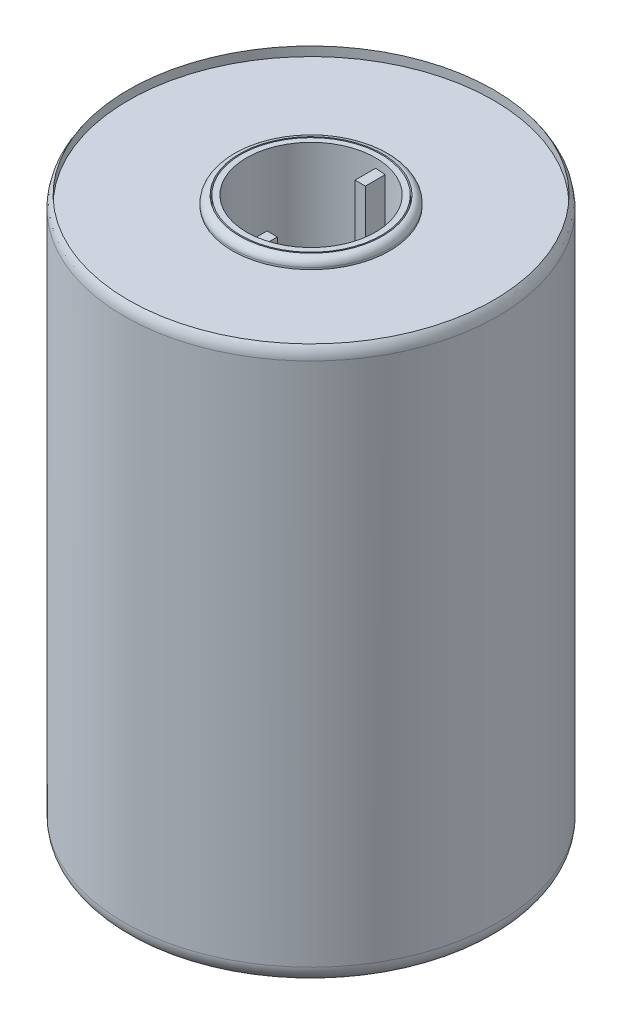
ISO-10303-21;
HEADER;
FILE_DESCRIPTION(('STEP AP214'),'2;1');
FILE_NAME('part.step','',(''),(''),'','','');
FILE_SCHEMA(('AUTOMOTIVE_DESIGN { 1 0 10303 214 1 1 1 1 }'));
ENDSEC;
DATA;
#1=APPLICATION_CONTEXT('core data for automotive mechanical design processes');
#2=APPLICATION_PROTOCOL_DEFINITION('international standard','automotive_design',2000,#1);
#3=PRODUCT_CONTEXT('',#1,'mechanical');
#4=PRODUCT('Part','Part','',(#3));
#5=PRODUCT_RELATED_PRODUCT_CATEGORY('part','',(#4));
#6=PRODUCT_DEFINITION_FORMATION('','',#4);
#7=PRODUCT_DEFINITION_CONTEXT('part definition',#1,'design');
#8=PRODUCT_DEFINITION('design','',#6,#7);
#9=PRODUCT_DEFINITION_SHAPE('','',#8);
#10=(LENGTH_UNIT() NAMED_UNIT(*) SI_UNIT(.MILLI.,.METRE.));
#11=(NAMED_UNIT(*) PLANE_ANGLE_UNIT() SI_UNIT($,.RADIAN.));
#12=(NAMED_UNIT(*) SI_UNIT($,.STERADIAN.) SOLID_ANGLE_UNIT());
#13=UNCERTAINTY_MEASURE_WITH_UNIT(LENGTH_MEASURE(1.E-05),#10,'distance_accuracy_value','');
#14=(GEOMETRIC_REPRESENTATION_CONTEXT(3) GLOBAL_UNCERTAINTY_ASSIGNED_CONTEXT((#13)) GLOBAL_UNIT_ASSIGNED_CONTEXT((#10,
#11,#12)) REPRESENTATION_CONTEXT('',''));
#15=CARTESIAN_POINT('',(0.,0.,0.));
#16=DIRECTION('',(0.,0.,1.));
#17=DIRECTION('',(1.,0.,0.));
#18=AXIS2_PLACEMENT_3D('',#15,#16,#17);
#19=CARTESIAN_POINT('',(0.,147.5,0.));
#20=DIRECTION('',(0.,1.,0.));
#21=DIRECTION('',(0.,0.,1.));
#22=AXIS2_PLACEMENT_3D('',#19,#20,#21);
#23=PLANE('',#22);
#24=CARTESIAN_POINT('',(0.,147.5,0.));
#25=DIRECTION('',(0.,1.,0.));
#26=DIRECTION('',(0.,0.,1.));
#27=AXIS2_PLACEMENT_3D('',#24,#25,#26);
#28=CIRCLE('',#27,19.1218292024238);
#29=CARTESIAN_POINT('',(0.,147.5,19.1218292024238));
#30=VERTEX_POINT('',#29);
#31=EDGE_CURVE('E174',#30,#30,#28,.T.);
#32=ORIENTED_EDGE('',*,*,#31,.F.);
#33=EDGE_LOOP('',(#32));
#34=FACE_BOUND('',#33,.T.);
#35=CARTESIAN_POINT('',(0.,147.5,0.));
#36=DIRECTION('',(0.,1.,0.));
#37=DIRECTION('',(0.,0.,1.));
#38=AXIS2_PLACEMENT_3D('',#35,#36,#37);
#39=CIRCLE('',#38,19.4629871836898);
#40=CARTESIAN_POINT('',(0.,147.5,19.4629871836898));
#41=VERTEX_POINT('',#40);
#42=EDGE_CURVE('E207',#41,#41,#39,.F.);
#43=ORIENTED_EDGE('',*,*,#42,.F.);
#44=EDGE_LOOP('',(#43));
#45=FACE_BOUND('',#44,.T.);
#46=ADVANCED_FACE('F37',(#34,#45),#23,.T.);
#47=CARTESIAN_POINT('',(0.,0.,0.));
#48=DIRECTION('',(0.,1.,0.));
#49=DIRECTION('',(0.,0.,1.));
#50=AXIS2_PLACEMENT_3D('',#47,#48,#49);
#51=CYLINDRICAL_SURFACE('',#50,17.5714106184439);
#52=DIRECTION('',(0.,1.,0.));
#53=VECTOR('',#52,1.);
#54=CARTESIAN_POINT('',(0.,2.5,17.5714106184439));
#55=LINE('',#54,#53);
#56=CARTESIAN_POINT('',(0.,2.5,17.5714106184439));
#57=VERTEX_POINT('',#56);
#58=CARTESIAN_POINT('',(0.,147.5,17.5714106184439));
#59=VERTEX_POINT('',#58);
#60=EDGE_CURVE('E57',#57,#59,#55,.T.);
#61=ORIENTED_EDGE('',*,*,#60,.F.);
#62=CARTESIAN_POINT('',(0.,2.5,0.));
#63=DIRECTION('',(0.,-1.,0.));
#64=DIRECTION('',(0.,0.,-1.));
#65=AXIS2_PLACEMENT_3D('',#62,#63,#64);
#66=CIRCLE('',#65,17.5714106184439);
#67=CARTESIAN_POINT('',(2.81398906962431,2.5,17.344622700941));
#68=VERTEX_POINT('',#67);
#69=EDGE_CURVE('E52',#57,#68,#66,.F.);
#70=ORIENTED_EDGE('',*,*,#69,.T.);
#71=DIRECTION('',(0.,1.,0.));
#72=VECTOR('',#71,1.);
#73=CARTESIAN_POINT('',(2.81398906962431,0.,17.344622700941));
#74=LINE('',#73,#72);
#75=CARTESIAN_POINT('',(2.81398906962431,147.5,17.344622700941));
#76=VERTEX_POINT('',#75);
#77=EDGE_CURVE('E106',#68,#76,#74,.T.);
#78=ORIENTED_EDGE('',*,*,#77,.T.);
#79=CARTESIAN_POINT('',(0.,147.5,0.));
#80=DIRECTION('',(0.,-1.,0.));
#81=DIRECTION('',(0.,0.,-1.));
#82=AXIS2_PLACEMENT_3D('',#79,#80,#81);
#83=CIRCLE('',#82,17.5714106184439);
#84=EDGE_CURVE('E202',#59,#76,#83,.F.);
#85=ORIENTED_EDGE('',*,*,#84,.F.);
#86=EDGE_LOOP('',(#61,#70,#78,#85));
#87=FACE_BOUND('',#86,.T.);
#88=CARTESIAN_POINT('',(0.,150.,0.));
#89=DIRECTION('',(0.,1.,0.));
#90=DIRECTION('',(0.,0.,1.));
#91=AXIS2_PLACEMENT_3D('',#88,#89,#90);
#92=CIRCLE('',#91,17.5714106184439);
#93=CARTESIAN_POINT('',(0.,150.,17.5714106184439));
#94=VERTEX_POINT('',#93);
#95=EDGE_CURVE('E183',#94,#94,#92,.T.);
#96=ORIENTED_EDGE('',*,*,#95,.T.);
#97=EDGE_LOOP('',(#96));
#98=FACE_BOUND('',#97,.T.);
#99=CARTESIAN_POINT('',(0.,0.,0.));
#100=DIRECTION('',(0.,1.,0.));
#101=DIRECTION('',(0.,0.,1.));
#102=AXIS2_PLACEMENT_3D('',#99,#100,#101);
#103=CIRCLE('',#102,17.5714106184439);
#104=CARTESIAN_POINT('',(0.,0.,17.5714106184439));
#105=VERTEX_POINT('',#104);
#106=EDGE_CURVE('E186',#105,#105,#103,.T.);
#107=ORIENTED_EDGE('',*,*,#106,.F.);
#108=EDGE_LOOP('',(#107));
#109=FACE_BOUND('',#108,.T.);
#110=CARTESIAN_POINT('',(0.,2.5,0.));
#111=DIRECTION('',(0.,1.,0.));
#112=DIRECTION('',(0.,0.,1.));
#113=AXIS2_PLACEMENT_3D('',#110,#111,#112);
#114=CIRCLE('',#113,17.5714106184439);
#115=CARTESIAN_POINT('',(0.,2.5,-17.5714106184439));
#116=VERTEX_POINT('',#115);
#117=CARTESIAN_POINT('',(2.81398906962431,2.5,-17.344622700941));
#118=VERTEX_POINT('',#117);
#119=EDGE_CURVE('E200',#116,#118,#114,.F.);
#120=ORIENTED_EDGE('',*,*,#119,.F.);
#121=DIRECTION('',(0.,1.,0.));
#122=VECTOR('',#121,1.);
#123=CARTESIAN_POINT('',(0.,2.5,-17.5714106184439));
#124=LINE('',#123,#122);
#125=CARTESIAN_POINT('',(0.,147.5,-17.5714106184439));
#126=VERTEX_POINT('',#125);
#127=EDGE_CURVE('E152',#116,#126,#124,.T.);
#128=ORIENTED_EDGE('',*,*,#127,.T.);
#129=CARTESIAN_POINT('',(0.,147.5,0.));
#130=DIRECTION('',(0.,1.,0.));
#131=DIRECTION('',(0.,0.,1.));
#132=AXIS2_PLACEMENT_3D('',#129,#130,#131);
#133=CIRCLE('',#132,17.5714106184439);
#134=CARTESIAN_POINT('',(2.81398906962431,147.5,-17.344622700941));
#135=VERTEX_POINT('',#134);
#136=EDGE_CURVE('E194',#126,#135,#133,.F.);
#137=ORIENTED_EDGE('',*,*,#136,.T.);
#138=DIRECTION('',(0.,1.,0.));
#139=VECTOR('',#138,1.);
#140=CARTESIAN_POINT('',(2.81398906962431,0.,-17.344622700941));
#141=LINE('',#140,#139);
#142=EDGE_CURVE('E197',#135,#118,#141,.F.);
#143=ORIENTED_EDGE('',*,*,#142,.T.);
#144=EDGE_LOOP('',(#120,#128,#137,#143));
#145=FACE_BOUND('',#144,.T.);
#146=ADVANCED_FACE('F247',(#87,#98,#109,#145),#51,.F.);
#147=CARTESIAN_POINT('',(0.,0.,0.));
#148=DIRECTION('',(0.,1.,0.));
#149=DIRECTION('',(0.,0.,1.));
#150=AXIS2_PLACEMENT_3D('',#147,#148,#149);
#151=PLANE('',#150);
#152=ORIENTED_EDGE('',*,*,#106,.T.);
#153=EDGE_LOOP('',(#152));
#154=FACE_BOUND('',#153,.T.);
#155=CARTESIAN_POINT('',(0.,0.,0.));
#156=DIRECTION('',(0.,-1.,0.));
#157=DIRECTION('',(0.,0.,-1.));
#158=AXIS2_PLACEMENT_3D('',#155,#156,#157);
#159=CIRCLE('',#158,17.829813715774);
#160=CARTESIAN_POINT('',(0.,0.,-17.829813715774));
#161=VERTEX_POINT('',#160);
#162=EDGE_CURVE('E165',#161,#161,#159,.T.);
#163=ORIENTED_EDGE('',*,*,#162,.T.);
#164=EDGE_LOOP('',(#163));
#165=FACE_BOUND('',#164,.T.);
#166=ADVANCED_FACE('F252',(#154,#165),#151,.F.);
#167=CARTESIAN_POINT('',(0.,150.,0.));
#168=DIRECTION('',(0.,1.,0.));
#169=DIRECTION('',(0.,0.,1.));
#170=AXIS2_PLACEMENT_3D('',#167,#168,#169);
#171=PLANE('',#170);
#172=ORIENTED_EDGE('',*,*,#95,.F.);
#173=EDGE_LOOP('',(#172));
#174=FACE_BOUND('',#173,.T.);
#175=CARTESIAN_POINT('',(0.,150.,0.));
#176=DIRECTION('',(0.,1.,0.));
#177=DIRECTION('',(0.,0.,1.));
#178=AXIS2_PLACEMENT_3D('',#175,#176,#177);
#179=CIRCLE('',#178,19.1218292024238);
#180=CARTESIAN_POINT('',(0.,150.,19.1218292024238));
#181=VERTEX_POINT('',#180);
#182=EDGE_CURVE('E171',#181,#181,#179,.T.);
#183=ORIENTED_EDGE('',*,*,#182,.T.);
#184=EDGE_LOOP('',(#183));
#185=FACE_BOUND('',#184,.T.);
#186=ADVANCED_FACE('F242',(#174,#185),#171,.T.);
#187=CARTESIAN_POINT('',(0.,150.,0.));
#188=DIRECTION('',(0.,-1.,0.));
#189=DIRECTION('',(0.,0.,-1.));
#190=AXIS2_PLACEMENT_3D('',#187,#188,#189);
#191=CYLINDRICAL_SURFACE('',#190,50.8900947095449);
#192=CARTESIAN_POINT('',(0.,146.783812157475,0.));
#193=DIRECTION('',(0.,1.,0.));
#194=DIRECTION('',(0.,0.,1.));
#195=AXIS2_PLACEMENT_3D('',#192,#193,#194);
#196=CIRCLE('',#195,50.8900947095449);
#197=CARTESIAN_POINT('',(0.,146.783812157475,50.8900947095449));
#198=VERTEX_POINT('',#197);
#199=EDGE_CURVE('E45',#198,#198,#196,.F.);
#200=ORIENTED_EDGE('',*,*,#199,.T.);
#201=EDGE_LOOP('',(#200));
#202=FACE_BOUND('',#201,.T.);
#203=CARTESIAN_POINT('',(0.,3.717971644845,0.));
#204=DIRECTION('',(0.,-1.,0.));
#205=DIRECTION('',(0.,0.,-1.));
#206=AXIS2_PLACEMENT_3D('',#203,#204,#205);
#207=CIRCLE('',#206,50.8900947095449);
#208=CARTESIAN_POINT('',(0.,3.717971644845,-50.8900947095449));
#209=VERTEX_POINT('',#208);
#210=EDGE_CURVE('E210',#209,#209,#207,.F.);
#211=ORIENTED_EDGE('',*,*,#210,.T.);
#212=EDGE_LOOP('',(#211));
#213=FACE_BOUND('',#212,.T.);
#214=ADVANCED_FACE('F221',(#202,#213),#191,.T.);
#215=CARTESIAN_POINT('',(0.,147.5,0.));
#216=DIRECTION('',(0.,1.,0.));
#217=DIRECTION('',(0.,0.,1.));
#218=AXIS2_PLACEMENT_3D('',#215,#216,#217);
#219=CYLINDRICAL_SURFACE('',#218,49.7184279972298);
#220=CARTESIAN_POINT('',(0.,147.5,0.));
#221=DIRECTION('',(0.,1.,0.));
#222=DIRECTION('',(0.,0.,1.));
#223=AXIS2_PLACEMENT_3D('',#220,#221,#222);
#224=CIRCLE('',#223,49.7184279972298);
#225=CARTESIAN_POINT('',(0.,147.5,49.7184279972298));
#226=VERTEX_POINT('',#225);
#227=EDGE_CURVE('E180',#226,#226,#224,.T.);
#228=ORIENTED_EDGE('',*,*,#227,.F.);
#229=EDGE_LOOP('',(#228));
#230=FACE_BOUND('',#229,.T.);
#231=CARTESIAN_POINT('',(0.,150.,0.));
#232=DIRECTION('',(0.,1.,0.));
#233=DIRECTION('',(0.,0.,1.));
#234=AXIS2_PLACEMENT_3D('',#231,#232,#233);
#235=CIRCLE('',#234,49.7184279972298);
#236=CARTESIAN_POINT('',(0.,150.,49.7184279972298));
#237=VERTEX_POINT('',#236);
#238=EDGE_CURVE('E177',#237,#237,#235,.T.);
#239=ORIENTED_EDGE('',*,*,#238,.T.);
#240=EDGE_LOOP('',(#239));
#241=FACE_BOUND('',#240,.T.);
#242=ADVANCED_FACE('F230',(#230,#241),#219,.F.);
#243=CARTESIAN_POINT('',(0.,147.5,0.));
#244=DIRECTION('',(0.,1.,0.));
#245=DIRECTION('',(0.,0.,1.));
#246=AXIS2_PLACEMENT_3D('',#243,#244,#245);
#247=CIRCLE('',#246,21.4211400149472);
#248=CARTESIAN_POINT('',(0.,147.5,21.4211400149472));
#249=VERTEX_POINT('',#248);
#250=EDGE_CURVE('E130',#249,#249,#247,.T.);
#251=ORIENTED_EDGE('',*,*,#250,.F.);
#252=EDGE_LOOP('',(#251));
#253=FACE_BOUND('',#252,.T.);
#254=ORIENTED_EDGE('',*,*,#227,.T.);
#255=EDGE_LOOP('',(#254));
#256=FACE_BOUND('',#255,.T.);
#257=ADVANCED_FACE('F232',(#253,#256),#23,.T.);
#258=CARTESIAN_POINT('',(0.,147.5,0.));
#259=DIRECTION('',(0.,1.,0.));
#260=DIRECTION('',(0.,0.,1.));
#261=AXIS2_PLACEMENT_3D('',#258,#259,#260);
#262=CYLINDRICAL_SURFACE('',#261,19.1218292024238);
#263=ORIENTED_EDGE('',*,*,#31,.T.);
#264=EDGE_LOOP('',(#263));
#265=FACE_BOUND('',#264,.T.);
#266=ORIENTED_EDGE('',*,*,#182,.F.);
#267=EDGE_LOOP('',(#266));
#268=FACE_BOUND('',#267,.T.);
#269=ADVANCED_FACE('F239',(#265,#268),#262,.T.);
#270=CARTESIAN_POINT('',(0.,-15.,0.));
#271=DIRECTION('',(0.,1.,0.));
#272=DIRECTION('',(0.,0.,1.));
#273=AXIS2_PLACEMENT_3D('',#270,#271,#272);
#274=CYLINDRICAL_SURFACE('',#273,19.4768924120961);
#275=CARTESIAN_POINT('',(0.,-11.2908331486245,0.));
#276=DIRECTION('',(0.,-1.,0.));
#277=DIRECTION('',(0.,0.,-1.));
#278=AXIS2_PLACEMENT_3D('',#275,#276,#277);
#279=CIRCLE('',#278,19.4768924120961);
#280=CARTESIAN_POINT('',(0.,-11.2908331486245,-19.4768924120961));
#281=VERTEX_POINT('',#280);
#282=EDGE_CURVE('E213',#281,#281,#279,.F.);
#283=ORIENTED_EDGE('',*,*,#282,.T.);
#284=EDGE_LOOP('',(#283));
#285=FACE_BOUND('',#284,.T.);
#286=CARTESIAN_POINT('',(0.,0.,0.));
#287=DIRECTION('',(0.,1.,0.));
#288=DIRECTION('',(0.,0.,1.));
#289=AXIS2_PLACEMENT_3D('',#286,#287,#288);
#290=CIRCLE('',#289,19.4768924120961);
#291=CARTESIAN_POINT('',(0.,0.,19.4768924120961));
#292=VERTEX_POINT('',#291);
#293=EDGE_CURVE('E189',#292,#292,#290,.F.);
#294=ORIENTED_EDGE('',*,*,#293,.T.);
#295=EDGE_LOOP('',(#294));
#296=FACE_BOUND('',#295,.T.);
#297=ADVANCED_FACE('F258',(#285,#296),#274,.T.);
#298=CARTESIAN_POINT('',(0.,-15.,0.));
#299=DIRECTION('',(0.,1.,0.));
#300=DIRECTION('',(0.,0.,1.));
#301=AXIS2_PLACEMENT_3D('',#298,#299,#300);
#302=CYLINDRICAL_SURFACE('',#301,17.829813715774);
#303=CARTESIAN_POINT('',(0.,-15.,0.));
#304=DIRECTION('',(0.,-1.,0.));
#305=DIRECTION('',(0.,0.,-1.));
#306=AXIS2_PLACEMENT_3D('',#303,#304,#305);
#307=CIRCLE('',#306,17.829813715774);
#308=CARTESIAN_POINT('',(0.,-15.,-17.829813715774));
#309=VERTEX_POINT('',#308);
#310=EDGE_CURVE('E168',#309,#309,#307,.T.);
#311=ORIENTED_EDGE('',*,*,#310,.T.);
#312=EDGE_LOOP('',(#311));
#313=FACE_BOUND('',#312,.T.);
#314=ORIENTED_EDGE('',*,*,#162,.F.);
#315=EDGE_LOOP('',(#314));
#316=FACE_BOUND('',#315,.T.);
#317=ADVANCED_FACE('F262',(#313,#316),#302,.F.);
#318=CARTESIAN_POINT('',(0.,5.,0.));
#319=DIRECTION('',(0.,-1.,0.));
#320=DIRECTION('',(0.,0.,-1.));
#321=AXIS2_PLACEMENT_3D('',#318,#319,#320);
#322=CYLINDRICAL_SURFACE('',#321,49.233249933002);
#323=CARTESIAN_POINT('',(0.,5.,0.));
#324=DIRECTION('',(0.,-1.,0.));
#325=DIRECTION('',(0.,0.,-1.));
#326=AXIS2_PLACEMENT_3D('',#323,#324,#325);
#327=CIRCLE('',#326,49.233249933002);
#328=CARTESIAN_POINT('',(0.,5.,-49.233249933002));
#329=VERTEX_POINT('',#328);
#330=EDGE_CURVE('E162',#329,#329,#327,.T.);
#331=ORIENTED_EDGE('',*,*,#330,.F.);
#332=EDGE_LOOP('',(#331));
#333=FACE_BOUND('',#332,.T.);
#334=CARTESIAN_POINT('',(0.,0.,0.));
#335=DIRECTION('',(0.,-1.,0.));
#336=DIRECTION('',(0.,0.,-1.));
#337=AXIS2_PLACEMENT_3D('',#334,#335,#336);
#338=CIRCLE('',#337,49.233249933002);
#339=CARTESIAN_POINT('',(0.,0.,-49.233249933002));
#340=VERTEX_POINT('',#339);
#341=EDGE_CURVE('E161',#340,#340,#338,.T.);
#342=ORIENTED_EDGE('',*,*,#341,.T.);
#343=EDGE_LOOP('',(#342));
#344=FACE_BOUND('',#343,.T.);
#345=ADVANCED_FACE('F266',(#333,#344),#322,.F.);
#346=CARTESIAN_POINT('',(0.,5.,0.));
#347=DIRECTION('',(0.,-1.,0.));
#348=DIRECTION('',(0.,0.,-1.));
#349=AXIS2_PLACEMENT_3D('',#346,#347,#348);
#350=PLANE('',#349);
#351=CARTESIAN_POINT('',(0.,5.,0.));
#352=DIRECTION('',(0.,-1.,0.));
#353=DIRECTION('',(0.,0.,-1.));
#354=AXIS2_PLACEMENT_3D('',#351,#352,#353);
#355=CIRCLE('',#354,21.5317394756691);
#356=CARTESIAN_POINT('',(0.,5.,-21.5317394756691));
#357=VERTEX_POINT('',#356);
#358=EDGE_CURVE('E155',#357,#357,#355,.T.);
#359=ORIENTED_EDGE('',*,*,#358,.F.);
#360=EDGE_LOOP('',(#359));
#361=FACE_BOUND('',#360,.T.);
#362=ORIENTED_EDGE('',*,*,#330,.T.);
#363=EDGE_LOOP('',(#362));
#364=FACE_BOUND('',#363,.T.);
#365=ADVANCED_FACE('F270',(#361,#364),#350,.T.);
#366=CARTESIAN_POINT('',(0.,5.,0.));
#367=DIRECTION('',(0.,-1.,0.));
#368=DIRECTION('',(0.,0.,-1.));
#369=AXIS2_PLACEMENT_3D('',#366,#367,#368);
#370=CYLINDRICAL_SURFACE('',#369,21.5317394756691);
#371=CARTESIAN_POINT('',(0.,4.04055369733593,0.));
#372=DIRECTION('',(0.,-1.,0.));
#373=DIRECTION('',(0.,0.,-1.));
#374=AXIS2_PLACEMENT_3D('',#371,#372,#373);
#375=CIRCLE('',#374,21.5317394756691);
#376=CARTESIAN_POINT('',(0.,4.04055369733593,-21.5317394756691));
#377=VERTEX_POINT('',#376);
#378=EDGE_CURVE('E216',#377,#377,#375,.F.);
#379=ORIENTED_EDGE('',*,*,#378,.T.);
#380=EDGE_LOOP('',(#379));
#381=FACE_BOUND('',#380,.T.);
#382=ORIENTED_EDGE('',*,*,#358,.T.);
#383=EDGE_LOOP('',(#382));
#384=FACE_BOUND('',#383,.T.);
#385=ADVANCED_FACE('F274',(#381,#384),#370,.T.);
#386=CARTESIAN_POINT('',(2.81398906962431,2.5,-17.5714106184439));
#387=DIRECTION('',(1.,0.,0.));
#388=DIRECTION('',(0.,0.,-1.));
#389=AXIS2_PLACEMENT_3D('',#386,#387,#388);
#390=PLANE('',#389);
#391=ORIENTED_EDGE('',*,*,#142,.F.);
#392=DIRECTION('',(0.,0.,-1.));
#393=VECTOR('',#392,1.);
#394=CARTESIAN_POINT('',(2.81398906962431,147.5,-17.5714106184439));
#395=LINE('',#394,#393);
#396=CARTESIAN_POINT('',(2.81398906962431,147.5,-11.9952929361759));
#397=VERTEX_POINT('',#396);
#398=EDGE_CURVE('E139',#397,#135,#395,.T.);
#399=ORIENTED_EDGE('',*,*,#398,.F.);
#400=DIRECTION('',(0.,1.,0.));
#401=VECTOR('',#400,1.);
#402=CARTESIAN_POINT('',(2.81398906962431,2.5,-11.9952929361759));
#403=LINE('',#402,#401);
#404=CARTESIAN_POINT('',(2.81398906962431,2.5,-11.9952929361759));
#405=VERTEX_POINT('',#404);
#406=EDGE_CURVE('E156',#405,#397,#403,.T.);
#407=ORIENTED_EDGE('',*,*,#406,.F.);
#408=DIRECTION('',(0.,0.,-1.));
#409=VECTOR('',#408,1.);
#410=CARTESIAN_POINT('',(2.81398906962431,2.5,-17.5714106184439));
#411=LINE('',#410,#409);
#412=EDGE_CURVE('E142',#405,#118,#411,.T.);
#413=ORIENTED_EDGE('',*,*,#412,.T.);
#414=EDGE_LOOP('',(#391,#399,#407,#413));
#415=FACE_BOUND('',#414,.T.);
#416=ADVANCED_FACE('F278',(#415),#390,.T.);
#417=CARTESIAN_POINT('',(0.,2.5,0.));
#418=DIRECTION('',(0.,1.,0.));
#419=DIRECTION('',(0.,0.,1.));
#420=AXIS2_PLACEMENT_3D('',#417,#418,#419);
#421=PLANE('',#420);
#422=DIRECTION('',(0.,0.,1.));
#423=VECTOR('',#422,1.);
#424=CARTESIAN_POINT('',(0.,2.5,-17.5714106184439));
#425=LINE('',#424,#423);
#426=CARTESIAN_POINT('',(0.,2.5,-11.9952929361759));
#427=VERTEX_POINT('',#426);
#428=EDGE_CURVE('E135',#116,#427,#425,.T.);
#429=ORIENTED_EDGE('',*,*,#428,.F.);
#430=ORIENTED_EDGE('',*,*,#119,.T.);
#431=ORIENTED_EDGE('',*,*,#412,.F.);
#432=DIRECTION('',(1.,0.,0.));
#433=VECTOR('',#432,1.);
#434=CARTESIAN_POINT('',(0.,2.5,-11.9952929361759));
#435=LINE('',#434,#433);
#436=EDGE_CURVE('E138',#427,#405,#435,.T.);
#437=ORIENTED_EDGE('',*,*,#436,.F.);
#438=EDGE_LOOP('',(#429,#430,#431,#437));
#439=FACE_BOUND('',#438,.T.);
#440=ADVANCED_FACE('F291',(#439),#421,.F.);
#441=CARTESIAN_POINT('',(0.,147.5,0.));
#442=DIRECTION('',(0.,1.,0.));
#443=DIRECTION('',(0.,0.,1.));
#444=AXIS2_PLACEMENT_3D('',#441,#442,#443);
#445=PLANE('',#444);
#446=ORIENTED_EDGE('',*,*,#136,.F.);
#447=DIRECTION('',(0.,0.,1.));
#448=VECTOR('',#447,1.);
#449=CARTESIAN_POINT('',(0.,147.5,-17.5714106184439));
#450=LINE('',#449,#448);
#451=CARTESIAN_POINT('',(0.,147.5,-11.9952929361759));
#452=VERTEX_POINT('',#451);
#453=EDGE_CURVE('E133',#126,#452,#450,.T.);
#454=ORIENTED_EDGE('',*,*,#453,.T.);
#455=DIRECTION('',(1.,0.,0.));
#456=VECTOR('',#455,1.);
#457=CARTESIAN_POINT('',(0.,147.5,-11.9952929361759));
#458=LINE('',#457,#456);
#459=EDGE_CURVE('E148',#452,#397,#458,.T.);
#460=ORIENTED_EDGE('',*,*,#459,.T.);
#461=ORIENTED_EDGE('',*,*,#398,.T.);
#462=EDGE_LOOP('',(#446,#454,#460,#461));
#463=FACE_BOUND('',#462,.T.);
#464=ADVANCED_FACE('F284',(#463),#445,.T.);
#465=CARTESIAN_POINT('',(0.,2.5,-17.5714106184439));
#466=DIRECTION('',(-1.,0.,0.));
#467=DIRECTION('',(0.,0.,1.));
#468=AXIS2_PLACEMENT_3D('',#465,#466,#467);
#469=PLANE('',#468);
#470=ORIENTED_EDGE('',*,*,#453,.F.);
#471=ORIENTED_EDGE('',*,*,#127,.F.);
#472=ORIENTED_EDGE('',*,*,#428,.T.);
#473=DIRECTION('',(0.,1.,0.));
#474=VECTOR('',#473,1.);
#475=CARTESIAN_POINT('',(0.,2.5,-11.9952929361759));
#476=LINE('',#475,#474);
#477=EDGE_CURVE('E145',#427,#452,#476,.T.);
#478=ORIENTED_EDGE('',*,*,#477,.T.);
#479=EDGE_LOOP('',(#470,#471,#472,#478));
#480=FACE_BOUND('',#479,.T.);
#481=ADVANCED_FACE('F280',(#480),#469,.T.);
#482=CARTESIAN_POINT('',(0.,2.5,-11.9952929361759));
#483=DIRECTION('',(0.,0.,1.));
#484=DIRECTION('',(1.,0.,0.));
#485=AXIS2_PLACEMENT_3D('',#482,#483,#484);
#486=PLANE('',#485);
#487=ORIENTED_EDGE('',*,*,#459,.F.);
#488=ORIENTED_EDGE('',*,*,#477,.F.);
#489=ORIENTED_EDGE('',*,*,#436,.T.);
#490=ORIENTED_EDGE('',*,*,#406,.T.);
#491=EDGE_LOOP('',(#487,#488,#489,#490));
#492=FACE_BOUND('',#491,.T.);
#493=ADVANCED_FACE('F283',(#492),#486,.T.);
#494=CARTESIAN_POINT('',(2.81398906962431,2.5,17.5714106184439));
#495=DIRECTION('',(1.,0.,0.));
#496=DIRECTION('',(0.,0.,-1.));
#497=AXIS2_PLACEMENT_3D('',#494,#495,#496);
#498=PLANE('',#497);
#499=ORIENTED_EDGE('',*,*,#77,.F.);
#500=DIRECTION('',(0.,0.,-1.));
#501=VECTOR('',#500,1.);
#502=CARTESIAN_POINT('',(2.81398906962431,2.5,17.5714106184439));
#503=LINE('',#502,#501);
#504=CARTESIAN_POINT('',(2.81398906962431,2.5,11.9952929361759));
#505=VERTEX_POINT('',#504);
#506=EDGE_CURVE('E100',#68,#505,#503,.T.);
#507=ORIENTED_EDGE('',*,*,#506,.T.);
#508=DIRECTION('',(0.,1.,0.));
#509=VECTOR('',#508,1.);
#510=CARTESIAN_POINT('',(2.81398906962431,2.5,11.9952929361759));
#511=LINE('',#510,#509);
#512=CARTESIAN_POINT('',(2.81398906962431,147.5,11.9952929361759));
#513=VERTEX_POINT('',#512);
#514=EDGE_CURVE('E104',#505,#513,#511,.T.);
#515=ORIENTED_EDGE('',*,*,#514,.T.);
#516=DIRECTION('',(0.,0.,-1.));
#517=VECTOR('',#516,1.);
#518=CARTESIAN_POINT('',(2.81398906962431,147.5,17.5714106184439));
#519=LINE('',#518,#517);
#520=EDGE_CURVE('E129',#76,#513,#519,.T.);
#521=ORIENTED_EDGE('',*,*,#520,.F.);
#522=EDGE_LOOP('',(#499,#507,#515,#521));
#523=FACE_BOUND('',#522,.T.);
#524=ADVANCED_FACE('F102',(#523),#498,.T.);
#525=CARTESIAN_POINT('',(0.,2.5,0.));
#526=DIRECTION('',(0.,-1.,0.));
#527=DIRECTION('',(0.,0.,-1.));
#528=AXIS2_PLACEMENT_3D('',#525,#526,#527);
#529=PLANE('',#528);
#530=ORIENTED_EDGE('',*,*,#69,.F.);
#531=DIRECTION('',(0.,0.,1.));
#532=VECTOR('',#531,1.);
#533=CARTESIAN_POINT('',(0.,2.5,17.5714106184439));
#534=LINE('',#533,#532);
#535=CARTESIAN_POINT('',(0.,2.5,11.9952929361759));
#536=VERTEX_POINT('',#535);
#537=EDGE_CURVE('E110',#536,#57,#534,.T.);
#538=ORIENTED_EDGE('',*,*,#537,.F.);
#539=DIRECTION('',(-1.,0.,0.));
#540=VECTOR('',#539,1.);
#541=CARTESIAN_POINT('',(0.,2.5,11.9952929361759));
#542=LINE('',#541,#540);
#543=EDGE_CURVE('E109',#505,#536,#542,.T.);
#544=ORIENTED_EDGE('',*,*,#543,.F.);
#545=ORIENTED_EDGE('',*,*,#506,.F.);
#546=EDGE_LOOP('',(#530,#538,#544,#545));
#547=FACE_BOUND('',#546,.T.);
#548=ADVANCED_FACE('F120',(#547),#529,.T.);
#549=CARTESIAN_POINT('',(0.,147.5,0.));
#550=DIRECTION('',(0.,-1.,0.));
#551=DIRECTION('',(0.,0.,-1.));
#552=AXIS2_PLACEMENT_3D('',#549,#550,#551);
#553=PLANE('',#552);
#554=DIRECTION('',(0.,0.,1.));
#555=VECTOR('',#554,1.);
#556=CARTESIAN_POINT('',(0.,147.5,17.5714106184439));
#557=LINE('',#556,#555);
#558=CARTESIAN_POINT('',(0.,147.5,11.9952929361759));
#559=VERTEX_POINT('',#558);
#560=EDGE_CURVE('E126',#559,#59,#557,.T.);
#561=ORIENTED_EDGE('',*,*,#560,.T.);
#562=ORIENTED_EDGE('',*,*,#84,.T.);
#563=ORIENTED_EDGE('',*,*,#520,.T.);
#564=DIRECTION('',(-1.,0.,0.));
#565=VECTOR('',#564,1.);
#566=CARTESIAN_POINT('',(0.,147.5,11.9952929361759));
#567=LINE('',#566,#565);
#568=EDGE_CURVE('E116',#513,#559,#567,.T.);
#569=ORIENTED_EDGE('',*,*,#568,.T.);
#570=EDGE_LOOP('',(#561,#562,#563,#569));
#571=FACE_BOUND('',#570,.T.);
#572=ADVANCED_FACE('F302',(#571),#553,.F.);
#573=CARTESIAN_POINT('',(0.,2.5,17.5714106184439));
#574=DIRECTION('',(-1.,0.,0.));
#575=DIRECTION('',(0.,0.,1.));
#576=AXIS2_PLACEMENT_3D('',#573,#574,#575);
#577=PLANE('',#576);
#578=ORIENTED_EDGE('',*,*,#560,.F.);
#579=DIRECTION('',(0.,1.,0.));
#580=VECTOR('',#579,1.);
#581=CARTESIAN_POINT('',(0.,2.5,11.9952929361759));
#582=LINE('',#581,#580);
#583=EDGE_CURVE('E117',#536,#559,#582,.T.);
#584=ORIENTED_EDGE('',*,*,#583,.F.);
#585=ORIENTED_EDGE('',*,*,#537,.T.);
#586=ORIENTED_EDGE('',*,*,#60,.T.);
#587=EDGE_LOOP('',(#578,#584,#585,#586));
#588=FACE_BOUND('',#587,.T.);
#589=ADVANCED_FACE('F299',(#588),#577,.T.);
#590=CARTESIAN_POINT('',(0.,2.5,11.9952929361759));
#591=DIRECTION('',(0.,0.,-1.));
#592=DIRECTION('',(-1.,0.,0.));
#593=AXIS2_PLACEMENT_3D('',#590,#591,#592);
#594=PLANE('',#593);
#595=ORIENTED_EDGE('',*,*,#568,.F.);
#596=ORIENTED_EDGE('',*,*,#514,.F.);
#597=ORIENTED_EDGE('',*,*,#543,.T.);
#598=ORIENTED_EDGE('',*,*,#583,.T.);
#599=EDGE_LOOP('',(#595,#596,#597,#598));
#600=FACE_BOUND('',#599,.T.);
#601=ADVANCED_FACE('F114',(#600),#594,.T.);
#602=CARTESIAN_POINT('',(0.,150.,0.));
#603=DIRECTION('',(0.,-1.,0.));
#604=DIRECTION('',(0.,0.,-1.));
#605=AXIS2_PLACEMENT_3D('',#602,#603,#604);
#606=CYLINDRICAL_SURFACE('',#605,21.4211400149472);
#607=CARTESIAN_POINT('',(0.,148.00043784431,0.));
#608=DIRECTION('',(0.,1.,0.));
#609=DIRECTION('',(0.,0.,1.));
#610=AXIS2_PLACEMENT_3D('',#607,#608,#609);
#611=CIRCLE('',#610,21.4211400149472);
#612=CARTESIAN_POINT('',(0.,148.00043784431,21.4211400149472));
#613=VERTEX_POINT('',#612);
#614=EDGE_CURVE('E11',#613,#613,#611,.F.);
#615=ORIENTED_EDGE('',*,*,#614,.T.);
#616=EDGE_LOOP('',(#615));
#617=FACE_BOUND('',#616,.T.);
#618=ORIENTED_EDGE('',*,*,#250,.T.);
#619=EDGE_LOOP('',(#618));
#620=FACE_BOUND('',#619,.T.);
#621=ADVANCED_FACE('F308',(#617,#620),#606,.T.);
#622=CARTESIAN_POINT('',(0.,150.,0.));
#623=DIRECTION('',(0.,-1.,0.));
#624=DIRECTION('',(0.,0.,-1.));
#625=AXIS2_PLACEMENT_3D('',#622,#623,#624);
#626=CYLINDRICAL_SURFACE('',#625,19.4629871836898);
#627=CARTESIAN_POINT('',(0.,150.,0.));
#628=DIRECTION('',(0.,1.,0.));
#629=DIRECTION('',(0.,0.,1.));
#630=AXIS2_PLACEMENT_3D('',#627,#628,#629);
#631=CIRCLE('',#630,19.4629871836898);
#632=CARTESIAN_POINT('',(0.,150.,19.4629871836898));
#633=VERTEX_POINT('',#632);
#634=EDGE_CURVE('E330',#633,#633,#631,.T.);
#635=ORIENTED_EDGE('',*,*,#634,.T.);
#636=EDGE_LOOP('',(#635));
#637=FACE_BOUND('',#636,.T.);
#638=ORIENTED_EDGE('',*,*,#42,.T.);
#639=EDGE_LOOP('',(#638));
#640=FACE_BOUND('',#639,.T.);
#641=ADVANCED_FACE('F316',(#637,#640),#626,.F.);
#642=CARTESIAN_POINT('',(0.,3.717971644845,0.));
#643=DIRECTION('',(0.,-1.,0.));
#644=DIRECTION('',(0.,0.,-1.));
#645=AXIS2_PLACEMENT_3D('',#642,#643,#644);
#646=TOROIDAL_SURFACE('',#645,45.8900947095449,5.);
#647=ORIENTED_EDGE('',*,*,#341,.F.);
#648=EDGE_LOOP('',(#647));
#649=FACE_BOUND('',#648,.T.);
#650=ORIENTED_EDGE('',*,*,#210,.F.);
#651=EDGE_LOOP('',(#650));
#652=FACE_BOUND('',#651,.T.);
#653=ADVANCED_FACE('F319',(#649,#652),#646,.T.);
#654=CARTESIAN_POINT('',(0.,-11.2908331486245,0.));
#655=DIRECTION('',(0.,-1.,0.));
#656=DIRECTION('',(0.,0.,-1.));
#657=AXIS2_PLACEMENT_3D('',#654,#655,#656);
#658=TOROIDAL_SURFACE('',#657,14.4768924120961,5.);
#659=ORIENTED_EDGE('',*,*,#282,.F.);
#660=EDGE_LOOP('',(#659));
#661=FACE_BOUND('',#660,.T.);
#662=ORIENTED_EDGE('',*,*,#310,.F.);
#663=EDGE_LOOP('',(#662));
#664=FACE_BOUND('',#663,.T.);
#665=ADVANCED_FACE('F324',(#661,#664),#658,.T.);
#666=CARTESIAN_POINT('',(0.,4.04055369733593,0.));
#667=DIRECTION('',(0.,-1.,0.));
#668=DIRECTION('',(0.,0.,-1.));
#669=AXIS2_PLACEMENT_3D('',#666,#667,#668);
#670=TOROIDAL_SURFACE('',#669,16.5317394756691,5.);
#671=ORIENTED_EDGE('',*,*,#378,.F.);
#672=EDGE_LOOP('',(#671));
#673=FACE_BOUND('',#672,.T.);
#674=ORIENTED_EDGE('',*,*,#293,.F.);
#675=EDGE_LOOP('',(#674));
#676=FACE_BOUND('',#675,.T.);
#677=ADVANCED_FACE('F227',(#673,#676),#670,.T.);
#678=CARTESIAN_POINT('',(0.,146.783812157475,0.));
#679=DIRECTION('',(0.,1.,0.));
#680=DIRECTION('',(0.,0.,1.));
#681=AXIS2_PLACEMENT_3D('',#678,#679,#680);
#682=TOROIDAL_SURFACE('',#681,45.8900947095449,5.);
#683=ORIENTED_EDGE('',*,*,#199,.F.);
#684=EDGE_LOOP('',(#683));
#685=FACE_BOUND('',#684,.T.);
#686=ORIENTED_EDGE('',*,*,#238,.F.);
#687=EDGE_LOOP('',(#686));
#688=FACE_BOUND('',#687,.T.);
#689=ADVANCED_FACE('F224',(#685,#688),#682,.T.);
#690=CARTESIAN_POINT('',(0.,148.00043784431,0.));
#691=DIRECTION('',(0.,1.,0.));
#692=DIRECTION('',(0.,0.,1.));
#693=AXIS2_PLACEMENT_3D('',#690,#691,#692);
#694=TOROIDAL_SURFACE('',#693,19.4211400149472,2.);
#695=ORIENTED_EDGE('',*,*,#614,.F.);
#696=EDGE_LOOP('',(#695));
#697=FACE_BOUND('',#696,.T.);
#698=ORIENTED_EDGE('',*,*,#634,.F.);
#699=EDGE_LOOP('',(#698));
#700=FACE_BOUND('',#699,.T.);
#701=ADVANCED_FACE('F39',(#697,#700),#694,.T.);
#702=CLOSED_SHELL('',(#46,#146,#166,#186,#214,#242,#257,#269,#297,#317,#345,#365,#385,#416,#440,
#464,#481,#493,#524,#548,#572,#589,#601,#621,#641,#653,#665,#677,#689,#701));
#703=MANIFOLD_SOLID_BREP('B2',#702);
#704=ADVANCED_BREP_SHAPE_REPRESENTATION('',(#18,#703),#14);
#705=SHAPE_DEFINITION_REPRESENTATION(#9,#704);
ENDSEC;
END-ISO-10303-21;
